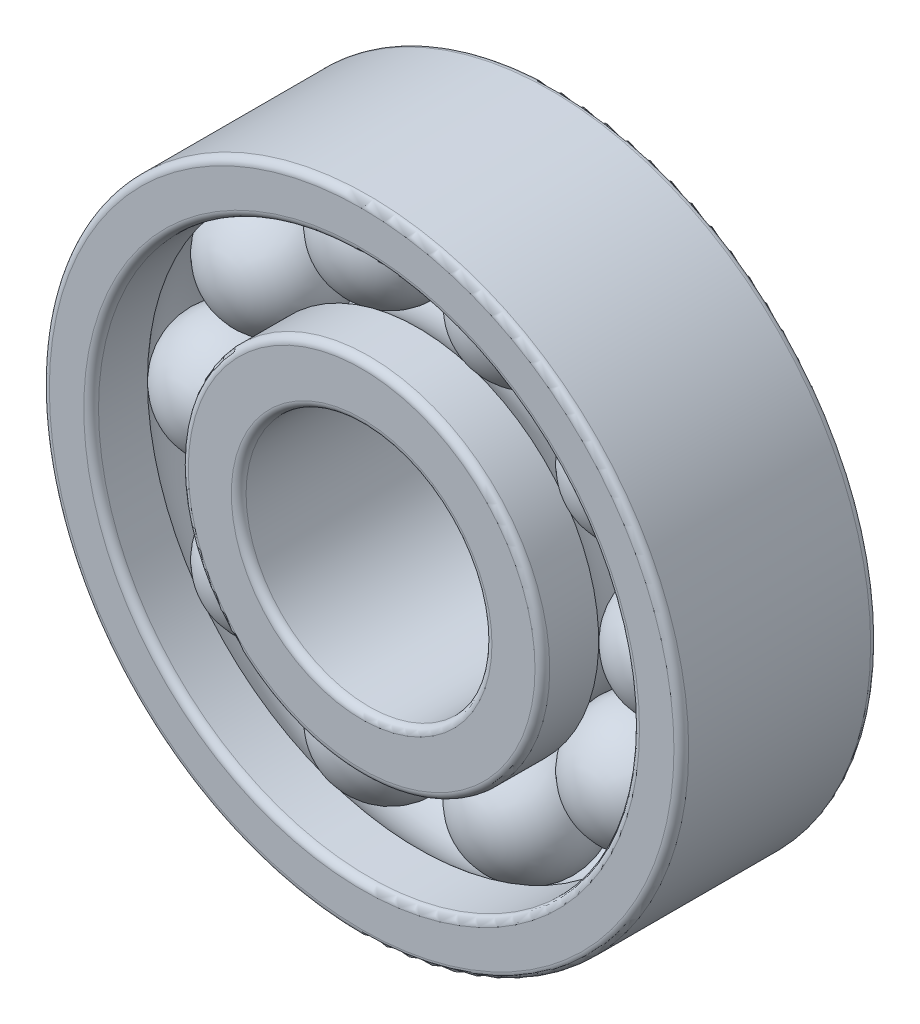
ISO-10303-21;
HEADER;
FILE_DESCRIPTION(('STEP AP214'),'2;1');
FILE_NAME('part.step','',(''),(''),'','','');
FILE_SCHEMA(('AUTOMOTIVE_DESIGN { 1 0 10303 214 1 1 1 1 }'));
ENDSEC;
DATA;
#1=APPLICATION_CONTEXT('core data for automotive mechanical design processes');
#2=APPLICATION_PROTOCOL_DEFINITION('international standard','automotive_design',2000,#1);
#3=PRODUCT_CONTEXT('',#1,'mechanical');
#4=PRODUCT('Part','Part','',(#3));
#5=PRODUCT_RELATED_PRODUCT_CATEGORY('part','',(#4));
#6=PRODUCT_DEFINITION_FORMATION('','',#4);
#7=PRODUCT_DEFINITION_CONTEXT('part definition',#1,'design');
#8=PRODUCT_DEFINITION('design','',#6,#7);
#9=PRODUCT_DEFINITION_SHAPE('','',#8);
#10=(LENGTH_UNIT() NAMED_UNIT(*) SI_UNIT(.MILLI.,.METRE.));
#11=(NAMED_UNIT(*) PLANE_ANGLE_UNIT() SI_UNIT($,.RADIAN.));
#12=(NAMED_UNIT(*) SI_UNIT($,.STERADIAN.) SOLID_ANGLE_UNIT());
#13=UNCERTAINTY_MEASURE_WITH_UNIT(LENGTH_MEASURE(1.E-05),#10,'distance_accuracy_value','');
#14=(GEOMETRIC_REPRESENTATION_CONTEXT(3) GLOBAL_UNCERTAINTY_ASSIGNED_CONTEXT((#13)) GLOBAL_UNIT_ASSIGNED_CONTEXT((#10,
#11,#12)) REPRESENTATION_CONTEXT('',''));
#15=CARTESIAN_POINT('',(0.,0.,0.));
#16=DIRECTION('',(0.,0.,1.));
#17=DIRECTION('',(1.,0.,0.));
#18=AXIS2_PLACEMENT_3D('',#15,#16,#17);
#19=CARTESIAN_POINT('',(-7.42273092339021,5.39292968978334,4.));
#20=DIRECTION('',(0.,0.,-1.));
#21=DIRECTION('',(0.809016994374955,-0.587785252292462,0.));
#22=AXIS2_PLACEMENT_3D('',#19,#20,#21);
#23=SPHERICAL_SURFACE('',#22,2.5);
#24=CARTESIAN_POINT('',(-7.42273092339021,5.39292968978334,1.5));
#25=VERTEX_POINT('',#24);
#26=VERTEX_LOOP('',#25);
#27=FACE_BOUND('',#26,.T.);
#28=ADVANCED_FACE('F76',(#27),#23,.T.);
#29=CLOSED_SHELL('',(#28));
#30=MANIFOLD_SOLID_BREP('B2',#29);
#31=CARTESIAN_POINT('',(-2.83523092339024,8.725943537008,4.));
#32=DIRECTION('',(0.,0.,-1.));
#33=DIRECTION('',(0.309016994374958,-0.95105651629515,0.));
#34=AXIS2_PLACEMENT_3D('',#31,#32,#33);
#35=SPHERICAL_SURFACE('',#34,2.5);
#36=CARTESIAN_POINT('',(-2.83523092339024,8.725943537008,1.5));
#37=VERTEX_POINT('',#36);
#38=VERTEX_LOOP('',#37);
#39=FACE_BOUND('',#38,.T.);
#40=ADVANCED_FACE('F95',(#39),#35,.T.);
#41=CLOSED_SHELL('',(#40));
#42=MANIFOLD_SOLID_BREP('B7',#41);
#43=CARTESIAN_POINT('',(2.83523092339006,8.72594353700806,4.));
#44=DIRECTION('',(0.,0.,-1.));
#45=DIRECTION('',(-0.309016994374938,-0.951056516295157,0.));
#46=AXIS2_PLACEMENT_3D('',#43,#44,#45);
#47=SPHERICAL_SURFACE('',#46,2.5);
#48=CARTESIAN_POINT('',(2.83523092339006,8.72594353700806,1.5));
#49=VERTEX_POINT('',#48);
#50=VERTEX_LOOP('',#49);
#51=FACE_BOUND('',#50,.T.);
#52=ADVANCED_FACE('F114',(#51),#47,.T.);
#53=CLOSED_SHELL('',(#52));
#54=MANIFOLD_SOLID_BREP('B72',#53);
#55=CARTESIAN_POINT('',(7.4227309233901,5.39292968978351,4.));
#56=DIRECTION('',(0.,0.,-1.));
#57=DIRECTION('',(-0.809016994374942,-0.58778525229248,0.));
#58=AXIS2_PLACEMENT_3D('',#55,#56,#57);
#59=SPHERICAL_SURFACE('',#58,2.5);
#60=CARTESIAN_POINT('',(7.4227309233901,5.39292968978351,1.5));
#61=VERTEX_POINT('',#60);
#62=VERTEX_LOOP('',#61);
#63=FACE_BOUND('',#62,.T.);
#64=ADVANCED_FACE('F133',(#63),#59,.T.);
#65=CLOSED_SHELL('',(#64));
#66=MANIFOLD_SOLID_BREP('B91',#65);
#67=CARTESIAN_POINT('',(9.175,0.,4.));
#68=DIRECTION('',(0.,0.,-1.));
#69=DIRECTION('',(-1.,0.,0.));
#70=AXIS2_PLACEMENT_3D('',#67,#68,#69);
#71=SPHERICAL_SURFACE('',#70,2.5);
#72=CARTESIAN_POINT('',(9.175,0.,1.5));
#73=VERTEX_POINT('',#72);
#74=VERTEX_LOOP('',#73);
#75=FACE_BOUND('',#74,.T.);
#76=ADVANCED_FACE('F152',(#75),#71,.T.);
#77=CLOSED_SHELL('',(#76));
#78=MANIFOLD_SOLID_BREP('B110',#77);
#79=CARTESIAN_POINT('',(7.42273092339017,-5.3929296897834,4.));
#80=DIRECTION('',(0.,0.,-1.));
#81=DIRECTION('',(-0.809016994374951,0.587785252292469,0.));
#82=AXIS2_PLACEMENT_3D('',#79,#80,#81);
#83=SPHERICAL_SURFACE('',#82,2.5);
#84=CARTESIAN_POINT('',(7.42273092339017,-5.3929296897834,1.5));
#85=VERTEX_POINT('',#84);
#86=VERTEX_LOOP('',#85);
#87=FACE_BOUND('',#86,.T.);
#88=ADVANCED_FACE('F171',(#87),#83,.T.);
#89=CLOSED_SHELL('',(#88));
#90=MANIFOLD_SOLID_BREP('B129',#89);
#91=CARTESIAN_POINT('',(2.83523092339018,-8.72594353700802,4.));
#92=DIRECTION('',(0.,0.,-1.));
#93=DIRECTION('',(-0.309016994374952,0.951056516295152,0.));
#94=AXIS2_PLACEMENT_3D('',#91,#92,#93);
#95=SPHERICAL_SURFACE('',#94,2.5);
#96=CARTESIAN_POINT('',(2.83523092339018,-8.72594353700802,1.5));
#97=VERTEX_POINT('',#96);
#98=VERTEX_LOOP('',#97);
#99=FACE_BOUND('',#98,.T.);
#100=ADVANCED_FACE('F190',(#99),#95,.T.);
#101=CLOSED_SHELL('',(#100));
#102=MANIFOLD_SOLID_BREP('B148',#101);
#103=CARTESIAN_POINT('',(-2.83523092339012,-8.72594353700804,4.));
#104=DIRECTION('',(0.,0.,-1.));
#105=DIRECTION('',(0.309016994374945,0.951056516295155,0.));
#106=AXIS2_PLACEMENT_3D('',#103,#104,#105);
#107=SPHERICAL_SURFACE('',#106,2.5);
#108=CARTESIAN_POINT('',(-2.83523092339012,-8.72594353700804,1.5));
#109=VERTEX_POINT('',#108);
#110=VERTEX_LOOP('',#109);
#111=FACE_BOUND('',#110,.T.);
#112=ADVANCED_FACE('F209',(#111),#107,.T.);
#113=CLOSED_SHELL('',(#112));
#114=MANIFOLD_SOLID_BREP('B167',#113);
#115=CARTESIAN_POINT('',(-7.42273092339014,-5.39292968978345,4.));
#116=DIRECTION('',(0.,0.,-1.));
#117=DIRECTION('',(0.809016994374947,0.587785252292474,0.));
#118=AXIS2_PLACEMENT_3D('',#115,#116,#117);
#119=SPHERICAL_SURFACE('',#118,2.5);
#120=CARTESIAN_POINT('',(-7.42273092339014,-5.39292968978345,1.5));
#121=VERTEX_POINT('',#120);
#122=VERTEX_LOOP('',#121);
#123=FACE_BOUND('',#122,.T.);
#124=ADVANCED_FACE('F228',(#123),#119,.T.);
#125=CLOSED_SHELL('',(#124));
#126=MANIFOLD_SOLID_BREP('B186',#125);
#127=CARTESIAN_POINT('',(-9.175,0.,4.));
#128=DIRECTION('',(0.,0.,-1.));
#129=DIRECTION('',(1.,0.,0.));
#130=AXIS2_PLACEMENT_3D('',#127,#128,#129);
#131=SPHERICAL_SURFACE('',#130,2.5);
#132=CARTESIAN_POINT('',(-9.175,0.,1.5));
#133=VERTEX_POINT('',#132);
#134=VERTEX_LOOP('',#133);
#135=FACE_BOUND('',#134,.T.);
#136=ADVANCED_FACE('F249',(#135),#131,.T.);
#137=CLOSED_SHELL('',(#136));
#138=MANIFOLD_SOLID_BREP('B205',#137);
#139=CARTESIAN_POINT('',(0.,0.,8.));
#140=DIRECTION('',(0.,0.,-1.));
#141=DIRECTION('',(-1.,0.,0.));
#142=AXIS2_PLACEMENT_3D('',#139,#140,#141);
#143=CYLINDRICAL_SURFACE('',#142,7.35);
#144=CARTESIAN_POINT('',(0.,0.,0.3));
#145=DIRECTION('',(0.,0.,1.));
#146=DIRECTION('',(1.,0.,0.));
#147=AXIS2_PLACEMENT_3D('',#144,#145,#146);
#148=CIRCLE('',#147,7.35);
#149=CARTESIAN_POINT('',(7.35,0.,0.3));
#150=VERTEX_POINT('',#149);
#151=EDGE_CURVE('E248',#150,#150,#148,.T.);
#152=ORIENTED_EDGE('',*,*,#151,.T.);
#153=EDGE_LOOP('',(#152));
#154=FACE_BOUND('',#153,.T.);
#155=CARTESIAN_POINT('',(0.,0.,2.29138213751582));
#156=DIRECTION('',(0.,0.,1.));
#157=DIRECTION('',(1.,0.,0.));
#158=AXIS2_PLACEMENT_3D('',#155,#156,#157);
#159=CIRCLE('',#158,7.35);
#160=CARTESIAN_POINT('',(7.35,0.,2.29138213751582));
#161=VERTEX_POINT('',#160);
#162=EDGE_CURVE('E301',#161,#161,#159,.F.);
#163=ORIENTED_EDGE('',*,*,#162,.T.);
#164=EDGE_LOOP('',(#163));
#165=FACE_BOUND('',#164,.T.);
#166=ADVANCED_FACE('F269',(#154,#165),#143,.T.);
#167=CARTESIAN_POINT('',(0.,0.,8.));
#168=DIRECTION('',(0.,0.,1.));
#169=DIRECTION('',(1.,0.,0.));
#170=AXIS2_PLACEMENT_3D('',#167,#168,#169);
#171=PLANE('',#170);
#172=CARTESIAN_POINT('',(0.,0.,8.));
#173=DIRECTION('',(0.,0.,1.));
#174=DIRECTION('',(1.,0.,0.));
#175=AXIS2_PLACEMENT_3D('',#172,#173,#174);
#176=CIRCLE('',#175,5.3);
#177=CARTESIAN_POINT('',(5.3,0.,8.));
#178=VERTEX_POINT('',#177);
#179=EDGE_CURVE('E289',#178,#178,#176,.F.);
#180=ORIENTED_EDGE('',*,*,#179,.T.);
#181=EDGE_LOOP('',(#180));
#182=FACE_BOUND('',#181,.T.);
#183=CARTESIAN_POINT('',(0.,0.,8.));
#184=DIRECTION('',(0.,0.,1.));
#185=DIRECTION('',(1.,0.,0.));
#186=AXIS2_PLACEMENT_3D('',#183,#184,#185);
#187=CIRCLE('',#186,7.05);
#188=CARTESIAN_POINT('',(7.05,0.,8.));
#189=VERTEX_POINT('',#188);
#190=EDGE_CURVE('E292',#189,#189,#187,.T.);
#191=ORIENTED_EDGE('',*,*,#190,.T.);
#192=EDGE_LOOP('',(#191));
#193=FACE_BOUND('',#192,.T.);
#194=ADVANCED_FACE('F319',(#182,#193),#171,.T.);
#195=CARTESIAN_POINT('',(0.,0.,0.));
#196=DIRECTION('',(0.,0.,1.));
#197=DIRECTION('',(1.,0.,0.));
#198=AXIS2_PLACEMENT_3D('',#195,#196,#197);
#199=PLANE('',#198);
#200=CARTESIAN_POINT('',(0.,0.,0.));
#201=DIRECTION('',(0.,0.,1.));
#202=DIRECTION('',(1.,0.,0.));
#203=AXIS2_PLACEMENT_3D('',#200,#201,#202);
#204=CIRCLE('',#203,5.3);
#205=CARTESIAN_POINT('',(5.3,0.,0.));
#206=VERTEX_POINT('',#205);
#207=EDGE_CURVE('E276',#206,#206,#204,.T.);
#208=ORIENTED_EDGE('',*,*,#207,.T.);
#209=EDGE_LOOP('',(#208));
#210=FACE_BOUND('',#209,.T.);
#211=CARTESIAN_POINT('',(0.,0.,0.));
#212=DIRECTION('',(0.,0.,1.));
#213=DIRECTION('',(1.,0.,0.));
#214=AXIS2_PLACEMENT_3D('',#211,#212,#213);
#215=CIRCLE('',#214,7.05);
#216=CARTESIAN_POINT('',(7.05,0.,0.));
#217=VERTEX_POINT('',#216);
#218=EDGE_CURVE('E280',#217,#217,#215,.F.);
#219=ORIENTED_EDGE('',*,*,#218,.T.);
#220=EDGE_LOOP('',(#219));
#221=FACE_BOUND('',#220,.T.);
#222=ADVANCED_FACE('F324',(#210,#221),#199,.F.);
#223=CARTESIAN_POINT('',(0.,0.,7.7));
#224=DIRECTION('',(0.,0.,1.));
#225=DIRECTION('',(1.,0.,0.));
#226=AXIS2_PLACEMENT_3D('',#223,#224,#225);
#227=CIRCLE('',#226,7.35);
#228=CARTESIAN_POINT('',(7.35,0.,7.7));
#229=VERTEX_POINT('',#228);
#230=EDGE_CURVE('E284',#229,#229,#227,.F.);
#231=ORIENTED_EDGE('',*,*,#230,.T.);
#232=EDGE_LOOP('',(#231));
#233=FACE_BOUND('',#232,.T.);
#234=CARTESIAN_POINT('',(0.,0.,5.70861786248418));
#235=DIRECTION('',(0.,0.,-1.));
#236=DIRECTION('',(-1.,0.,0.));
#237=AXIS2_PLACEMENT_3D('',#234,#235,#236);
#238=CIRCLE('',#237,7.35);
#239=CARTESIAN_POINT('',(-7.35,0.,5.70861786248418));
#240=VERTEX_POINT('',#239);
#241=EDGE_CURVE('E304',#240,#240,#238,.F.);
#242=ORIENTED_EDGE('',*,*,#241,.T.);
#243=EDGE_LOOP('',(#242));
#244=FACE_BOUND('',#243,.T.);
#245=ADVANCED_FACE('F308',(#233,#244),#143,.T.);
#246=CARTESIAN_POINT('',(0.,0.,8.));
#247=DIRECTION('',(0.,0.,-1.));
#248=DIRECTION('',(-1.,0.,0.));
#249=AXIS2_PLACEMENT_3D('',#246,#247,#248);
#250=CYLINDRICAL_SURFACE('',#249,5.);
#251=CARTESIAN_POINT('',(0.,0.,7.7));
#252=DIRECTION('',(0.,0.,1.));
#253=DIRECTION('',(1.,0.,0.));
#254=AXIS2_PLACEMENT_3D('',#251,#252,#253);
#255=CIRCLE('',#254,5.);
#256=CARTESIAN_POINT('',(5.,0.,7.7));
#257=VERTEX_POINT('',#256);
#258=EDGE_CURVE('E295',#257,#257,#255,.T.);
#259=ORIENTED_EDGE('',*,*,#258,.T.);
#260=EDGE_LOOP('',(#259));
#261=FACE_BOUND('',#260,.T.);
#262=CARTESIAN_POINT('',(0.,0.,0.3));
#263=DIRECTION('',(0.,0.,1.));
#264=DIRECTION('',(1.,0.,0.));
#265=AXIS2_PLACEMENT_3D('',#262,#263,#264);
#266=CIRCLE('',#265,5.);
#267=CARTESIAN_POINT('',(5.,0.,0.3));
#268=VERTEX_POINT('',#267);
#269=EDGE_CURVE('E298',#268,#268,#266,.F.);
#270=ORIENTED_EDGE('',*,*,#269,.T.);
#271=EDGE_LOOP('',(#270));
#272=FACE_BOUND('',#271,.T.);
#273=ADVANCED_FACE('F314',(#261,#272),#250,.F.);
#274=CARTESIAN_POINT('',(0.,0.,4.));
#275=DIRECTION('',(0.,0.,-1.));
#276=DIRECTION('',(-1.,0.,0.));
#277=AXIS2_PLACEMENT_3D('',#274,#275,#276);
#278=TOROIDAL_SURFACE('',#277,9.175,2.5);
#279=ORIENTED_EDGE('',*,*,#241,.F.);
#280=EDGE_LOOP('',(#279));
#281=FACE_BOUND('',#280,.T.);
#282=ORIENTED_EDGE('',*,*,#162,.F.);
#283=EDGE_LOOP('',(#282));
#284=FACE_BOUND('',#283,.T.);
#285=ADVANCED_FACE('F310',(#281,#284),#278,.F.);
#286=CARTESIAN_POINT('',(0.,0.,7.7));
#287=DIRECTION('',(0.,0.,1.));
#288=DIRECTION('',(1.,0.,0.));
#289=AXIS2_PLACEMENT_3D('',#286,#287,#288);
#290=TOROIDAL_SURFACE('',#289,5.3,0.3);
#291=ORIENTED_EDGE('',*,*,#179,.F.);
#292=EDGE_LOOP('',(#291));
#293=FACE_BOUND('',#292,.T.);
#294=ORIENTED_EDGE('',*,*,#258,.F.);
#295=EDGE_LOOP('',(#294));
#296=FACE_BOUND('',#295,.T.);
#297=ADVANCED_FACE('F313',(#293,#296),#290,.T.);
#298=CARTESIAN_POINT('',(0.,0.,7.7));
#299=DIRECTION('',(0.,0.,1.));
#300=DIRECTION('',(1.,0.,0.));
#301=AXIS2_PLACEMENT_3D('',#298,#299,#300);
#302=TOROIDAL_SURFACE('',#301,7.05,0.3);
#303=ORIENTED_EDGE('',*,*,#230,.F.);
#304=EDGE_LOOP('',(#303));
#305=FACE_BOUND('',#304,.T.);
#306=ORIENTED_EDGE('',*,*,#190,.F.);
#307=EDGE_LOOP('',(#306));
#308=FACE_BOUND('',#307,.T.);
#309=ADVANCED_FACE('F338',(#305,#308),#302,.T.);
#310=CARTESIAN_POINT('',(0.,0.,0.3));
#311=DIRECTION('',(0.,0.,1.));
#312=DIRECTION('',(1.,0.,0.));
#313=AXIS2_PLACEMENT_3D('',#310,#311,#312);
#314=TOROIDAL_SURFACE('',#313,5.3,0.3);
#315=ORIENTED_EDGE('',*,*,#269,.F.);
#316=EDGE_LOOP('',(#315));
#317=FACE_BOUND('',#316,.T.);
#318=ORIENTED_EDGE('',*,*,#207,.F.);
#319=EDGE_LOOP('',(#318));
#320=FACE_BOUND('',#319,.T.);
#321=ADVANCED_FACE('F341',(#317,#320),#314,.T.);
#322=CARTESIAN_POINT('',(0.,0.,0.3));
#323=DIRECTION('',(0.,0.,1.));
#324=DIRECTION('',(1.,0.,0.));
#325=AXIS2_PLACEMENT_3D('',#322,#323,#324);
#326=TOROIDAL_SURFACE('',#325,7.05,0.3);
#327=ORIENTED_EDGE('',*,*,#218,.F.);
#328=EDGE_LOOP('',(#327));
#329=FACE_BOUND('',#328,.T.);
#330=ORIENTED_EDGE('',*,*,#151,.F.);
#331=EDGE_LOOP('',(#330));
#332=FACE_BOUND('',#331,.T.);
#333=ADVANCED_FACE('F271',(#329,#332),#326,.T.);
#334=CLOSED_SHELL('',(#166,#194,#222,#245,#273,#285,#297,#309,#321,#333));
#335=MANIFOLD_SOLID_BREP('B224',#334);
#336=CARTESIAN_POINT('',(0.,0.,8.));
#337=DIRECTION('',(0.,0.,-1.));
#338=DIRECTION('',(-1.,0.,0.));
#339=AXIS2_PLACEMENT_3D('',#336,#337,#338);
#340=CYLINDRICAL_SURFACE('',#339,11.);
#341=CARTESIAN_POINT('',(0.,0.,0.3));
#342=DIRECTION('',(0.,0.,1.));
#343=DIRECTION('',(1.,0.,0.));
#344=AXIS2_PLACEMENT_3D('',#341,#342,#343);
#345=CIRCLE('',#344,11.);
#346=CARTESIAN_POINT('',(11.,0.,0.3));
#347=VERTEX_POINT('',#346);
#348=EDGE_CURVE('E443',#347,#347,#345,.F.);
#349=ORIENTED_EDGE('',*,*,#348,.T.);
#350=EDGE_LOOP('',(#349));
#351=FACE_BOUND('',#350,.T.);
#352=CARTESIAN_POINT('',(0.,0.,2.29138213751582));
#353=DIRECTION('',(0.,0.,1.));
#354=DIRECTION('',(1.,0.,0.));
#355=AXIS2_PLACEMENT_3D('',#352,#353,#354);
#356=CIRCLE('',#355,11.);
#357=CARTESIAN_POINT('',(11.,0.,2.29138213751582));
#358=VERTEX_POINT('',#357);
#359=EDGE_CURVE('E452',#358,#358,#356,.F.);
#360=ORIENTED_EDGE('',*,*,#359,.F.);
#361=EDGE_LOOP('',(#360));
#362=FACE_BOUND('',#361,.T.);
#363=ADVANCED_FACE('F420',(#351,#362),#340,.F.);
#364=CARTESIAN_POINT('',(0.,0.,8.));
#365=DIRECTION('',(0.,0.,1.));
#366=DIRECTION('',(1.,0.,0.));
#367=AXIS2_PLACEMENT_3D('',#364,#365,#366);
#368=PLANE('',#367);
#369=CARTESIAN_POINT('',(0.,0.,8.));
#370=DIRECTION('',(0.,0.,1.));
#371=DIRECTION('',(1.,0.,0.));
#372=AXIS2_PLACEMENT_3D('',#369,#370,#371);
#373=CIRCLE('',#372,11.3);
#374=CARTESIAN_POINT('',(11.3,0.,8.));
#375=VERTEX_POINT('',#374);
#376=EDGE_CURVE('E268',#375,#375,#373,.F.);
#377=ORIENTED_EDGE('',*,*,#376,.T.);
#378=EDGE_LOOP('',(#377));
#379=FACE_BOUND('',#378,.T.);
#380=CARTESIAN_POINT('',(0.,0.,8.));
#381=DIRECTION('',(0.,0.,1.));
#382=DIRECTION('',(1.,0.,0.));
#383=AXIS2_PLACEMENT_3D('',#380,#381,#382);
#384=CIRCLE('',#383,12.7);
#385=CARTESIAN_POINT('',(12.7,0.,8.));
#386=VERTEX_POINT('',#385);
#387=EDGE_CURVE('E427',#386,#386,#384,.T.);
#388=ORIENTED_EDGE('',*,*,#387,.T.);
#389=EDGE_LOOP('',(#388));
#390=FACE_BOUND('',#389,.T.);
#391=ADVANCED_FACE('F478',(#379,#390),#368,.T.);
#392=CARTESIAN_POINT('',(0.,0.,0.));
#393=DIRECTION('',(0.,0.,1.));
#394=DIRECTION('',(1.,0.,0.));
#395=AXIS2_PLACEMENT_3D('',#392,#393,#394);
#396=PLANE('',#395);
#397=CARTESIAN_POINT('',(0.,0.,0.));
#398=DIRECTION('',(0.,0.,1.));
#399=DIRECTION('',(1.,0.,0.));
#400=AXIS2_PLACEMENT_3D('',#397,#398,#399);
#401=CIRCLE('',#400,11.3);
#402=CARTESIAN_POINT('',(11.3,0.,0.));
#403=VERTEX_POINT('',#402);
#404=EDGE_CURVE('E446',#403,#403,#401,.T.);
#405=ORIENTED_EDGE('',*,*,#404,.T.);
#406=EDGE_LOOP('',(#405));
#407=FACE_BOUND('',#406,.T.);
#408=CARTESIAN_POINT('',(0.,0.,0.));
#409=DIRECTION('',(0.,0.,1.));
#410=DIRECTION('',(1.,0.,0.));
#411=AXIS2_PLACEMENT_3D('',#408,#409,#410);
#412=CIRCLE('',#411,12.7);
#413=CARTESIAN_POINT('',(12.7,0.,0.));
#414=VERTEX_POINT('',#413);
#415=EDGE_CURVE('E449',#414,#414,#412,.F.);
#416=ORIENTED_EDGE('',*,*,#415,.T.);
#417=EDGE_LOOP('',(#416));
#418=FACE_BOUND('',#417,.T.);
#419=ADVANCED_FACE('F473',(#407,#418),#396,.F.);
#420=CARTESIAN_POINT('',(0.,0.,8.));
#421=DIRECTION('',(0.,0.,-1.));
#422=DIRECTION('',(-1.,0.,0.));
#423=AXIS2_PLACEMENT_3D('',#420,#421,#422);
#424=CYLINDRICAL_SURFACE('',#423,13.);
#425=CARTESIAN_POINT('',(0.,0.,0.3));
#426=DIRECTION('',(0.,0.,1.));
#427=DIRECTION('',(1.,0.,0.));
#428=AXIS2_PLACEMENT_3D('',#425,#426,#427);
#429=CIRCLE('',#428,13.);
#430=CARTESIAN_POINT('',(13.,0.,0.3));
#431=VERTEX_POINT('',#430);
#432=EDGE_CURVE('E435',#431,#431,#429,.T.);
#433=ORIENTED_EDGE('',*,*,#432,.T.);
#434=EDGE_LOOP('',(#433));
#435=FACE_BOUND('',#434,.T.);
#436=CARTESIAN_POINT('',(0.,0.,7.7));
#437=DIRECTION('',(0.,0.,1.));
#438=DIRECTION('',(1.,0.,0.));
#439=AXIS2_PLACEMENT_3D('',#436,#437,#438);
#440=CIRCLE('',#439,13.);
#441=CARTESIAN_POINT('',(13.,0.,7.7));
#442=VERTEX_POINT('',#441);
#443=EDGE_CURVE('E440',#442,#442,#440,.F.);
#444=ORIENTED_EDGE('',*,*,#443,.T.);
#445=EDGE_LOOP('',(#444));
#446=FACE_BOUND('',#445,.T.);
#447=ADVANCED_FACE('F463',(#435,#446),#424,.T.);
#448=CARTESIAN_POINT('',(0.,0.,7.7));
#449=DIRECTION('',(0.,0.,1.));
#450=DIRECTION('',(1.,0.,0.));
#451=AXIS2_PLACEMENT_3D('',#448,#449,#450);
#452=CIRCLE('',#451,11.);
#453=CARTESIAN_POINT('',(11.,0.,7.7));
#454=VERTEX_POINT('',#453);
#455=EDGE_CURVE('E431',#454,#454,#452,.T.);
#456=ORIENTED_EDGE('',*,*,#455,.T.);
#457=EDGE_LOOP('',(#456));
#458=FACE_BOUND('',#457,.T.);
#459=CARTESIAN_POINT('',(0.,0.,5.70861786248418));
#460=DIRECTION('',(0.,0.,-1.));
#461=DIRECTION('',(-1.,0.,0.));
#462=AXIS2_PLACEMENT_3D('',#459,#460,#461);
#463=CIRCLE('',#462,11.);
#464=CARTESIAN_POINT('',(-11.,0.,5.70861786248418));
#465=VERTEX_POINT('',#464);
#466=EDGE_CURVE('E455',#465,#465,#463,.F.);
#467=ORIENTED_EDGE('',*,*,#466,.F.);
#468=EDGE_LOOP('',(#467));
#469=FACE_BOUND('',#468,.T.);
#470=ADVANCED_FACE('F461',(#458,#469),#340,.F.);
#471=CARTESIAN_POINT('',(0.,0.,4.));
#472=DIRECTION('',(0.,0.,-1.));
#473=DIRECTION('',(-1.,0.,0.));
#474=AXIS2_PLACEMENT_3D('',#471,#472,#473);
#475=TOROIDAL_SURFACE('',#474,9.175,2.5);
#476=ORIENTED_EDGE('',*,*,#359,.T.);
#477=EDGE_LOOP('',(#476));
#478=FACE_BOUND('',#477,.T.);
#479=ORIENTED_EDGE('',*,*,#466,.T.);
#480=EDGE_LOOP('',(#479));
#481=FACE_BOUND('',#480,.T.);
#482=ADVANCED_FACE('F459',(#478,#481),#475,.F.);
#483=CARTESIAN_POINT('',(0.,0.,0.3));
#484=DIRECTION('',(0.,0.,1.));
#485=DIRECTION('',(1.,0.,0.));
#486=AXIS2_PLACEMENT_3D('',#483,#484,#485);
#487=TOROIDAL_SURFACE('',#486,11.3,0.3);
#488=ORIENTED_EDGE('',*,*,#348,.F.);
#489=EDGE_LOOP('',(#488));
#490=FACE_BOUND('',#489,.T.);
#491=ORIENTED_EDGE('',*,*,#404,.F.);
#492=EDGE_LOOP('',(#491));
#493=FACE_BOUND('',#492,.T.);
#494=ADVANCED_FACE('F470',(#490,#493),#487,.T.);
#495=CARTESIAN_POINT('',(0.,0.,0.3));
#496=DIRECTION('',(0.,0.,1.));
#497=DIRECTION('',(1.,0.,0.));
#498=AXIS2_PLACEMENT_3D('',#495,#496,#497);
#499=TOROIDAL_SURFACE('',#498,12.7,0.3);
#500=ORIENTED_EDGE('',*,*,#415,.F.);
#501=EDGE_LOOP('',(#500));
#502=FACE_BOUND('',#501,.T.);
#503=ORIENTED_EDGE('',*,*,#432,.F.);
#504=EDGE_LOOP('',(#503));
#505=FACE_BOUND('',#504,.T.);
#506=ADVANCED_FACE('F489',(#502,#505),#499,.T.);
#507=CARTESIAN_POINT('',(0.,0.,7.7));
#508=DIRECTION('',(0.,0.,1.));
#509=DIRECTION('',(1.,0.,0.));
#510=AXIS2_PLACEMENT_3D('',#507,#508,#509);
#511=TOROIDAL_SURFACE('',#510,11.3,0.3);
#512=ORIENTED_EDGE('',*,*,#376,.F.);
#513=EDGE_LOOP('',(#512));
#514=FACE_BOUND('',#513,.T.);
#515=ORIENTED_EDGE('',*,*,#455,.F.);
#516=EDGE_LOOP('',(#515));
#517=FACE_BOUND('',#516,.T.);
#518=ADVANCED_FACE('F500',(#514,#517),#511,.T.);
#519=CARTESIAN_POINT('',(0.,0.,7.7));
#520=DIRECTION('',(0.,0.,1.));
#521=DIRECTION('',(1.,0.,0.));
#522=AXIS2_PLACEMENT_3D('',#519,#520,#521);
#523=TOROIDAL_SURFACE('',#522,12.7,0.3);
#524=ORIENTED_EDGE('',*,*,#443,.F.);
#525=EDGE_LOOP('',(#524));
#526=FACE_BOUND('',#525,.T.);
#527=ORIENTED_EDGE('',*,*,#387,.F.);
#528=EDGE_LOOP('',(#527));
#529=FACE_BOUND('',#528,.T.);
#530=ADVANCED_FACE('F422',(#526,#529),#523,.T.);
#531=CLOSED_SHELL('',(#363,#391,#419,#447,#470,#482,#494,#506,#518,#530));
#532=MANIFOLD_SOLID_BREP('B243',#531);
#533=ADVANCED_BREP_SHAPE_REPRESENTATION('',(#18,#30,#42,#54,#66,#78,#90,#102,#114,#126,#138,
#335,#532),#14);
#534=SHAPE_DEFINITION_REPRESENTATION(#9,#533);
ENDSEC;
END-ISO-10303-21;
